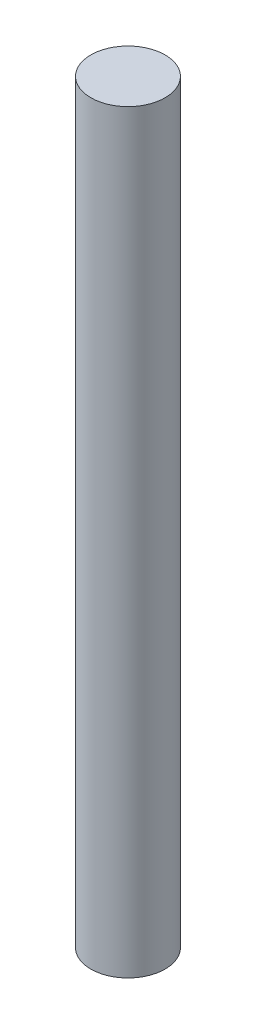
ISO-10303-21;
HEADER;
FILE_DESCRIPTION(('STEP AP214'),'2;1');
FILE_NAME('part.step','',(''),(''),'','','');
FILE_SCHEMA(('AUTOMOTIVE_DESIGN { 1 0 10303 214 1 1 1 1 }'));
ENDSEC;
DATA;
#1=APPLICATION_CONTEXT('core data for automotive mechanical design processes');
#2=APPLICATION_PROTOCOL_DEFINITION('international standard','automotive_design',2000,#1);
#3=PRODUCT_CONTEXT('',#1,'mechanical');
#4=PRODUCT('Part','Part','',(#3));
#5=PRODUCT_RELATED_PRODUCT_CATEGORY('part','',(#4));
#6=PRODUCT_DEFINITION_FORMATION('','',#4);
#7=PRODUCT_DEFINITION_CONTEXT('part definition',#1,'design');
#8=PRODUCT_DEFINITION('design','',#6,#7);
#9=PRODUCT_DEFINITION_SHAPE('','',#8);
#10=(LENGTH_UNIT() NAMED_UNIT(*) SI_UNIT(.MILLI.,.METRE.));
#11=(NAMED_UNIT(*) PLANE_ANGLE_UNIT() SI_UNIT($,.RADIAN.));
#12=(NAMED_UNIT(*) SI_UNIT($,.STERADIAN.) SOLID_ANGLE_UNIT());
#13=UNCERTAINTY_MEASURE_WITH_UNIT(LENGTH_MEASURE(1.E-05),#10,'distance_accuracy_value','');
#14=(GEOMETRIC_REPRESENTATION_CONTEXT(3) GLOBAL_UNCERTAINTY_ASSIGNED_CONTEXT((#13)) GLOBAL_UNIT_ASSIGNED_CONTEXT((#10,
#11,#12)) REPRESENTATION_CONTEXT('',''));
#15=CARTESIAN_POINT('',(0.,0.,0.));
#16=DIRECTION('',(0.,0.,1.));
#17=DIRECTION('',(1.,0.,0.));
#18=AXIS2_PLACEMENT_3D('',#15,#16,#17);
#19=CARTESIAN_POINT('',(0.,50.8,0.));
#20=DIRECTION('',(0.,-1.,0.));
#21=DIRECTION('',(0.,0.,-1.));
#22=AXIS2_PLACEMENT_3D('',#19,#20,#21);
#23=CYLINDRICAL_SURFACE('',#22,2.5);
#24=CARTESIAN_POINT('',(0.,50.8,0.));
#25=DIRECTION('',(0.,1.,0.));
#26=DIRECTION('',(0.,0.,1.));
#27=AXIS2_PLACEMENT_3D('',#24,#25,#26);
#28=CIRCLE('',#27,2.5);
#29=CARTESIAN_POINT('',(0.,50.8,2.5));
#30=VERTEX_POINT('',#29);
#31=EDGE_CURVE('E10',#30,#30,#28,.T.);
#32=ORIENTED_EDGE('',*,*,#31,.F.);
#33=EDGE_LOOP('',(#32));
#34=FACE_BOUND('',#33,.T.);
#35=CARTESIAN_POINT('',(0.,0.,0.));
#36=DIRECTION('',(0.,1.,0.));
#37=DIRECTION('',(0.,0.,1.));
#38=AXIS2_PLACEMENT_3D('',#35,#36,#37);
#39=CIRCLE('',#38,2.5);
#40=CARTESIAN_POINT('',(0.,0.,2.5));
#41=VERTEX_POINT('',#40);
#42=EDGE_CURVE('E40',#41,#41,#39,.T.);
#43=ORIENTED_EDGE('',*,*,#42,.T.);
#44=EDGE_LOOP('',(#43));
#45=FACE_BOUND('',#44,.T.);
#46=ADVANCED_FACE('F37',(#34,#45),#23,.T.);
#47=CARTESIAN_POINT('',(0.,50.8,0.));
#48=DIRECTION('',(0.,1.,0.));
#49=DIRECTION('',(0.,0.,1.));
#50=AXIS2_PLACEMENT_3D('',#47,#48,#49);
#51=PLANE('',#50);
#52=ORIENTED_EDGE('',*,*,#31,.T.);
#53=EDGE_LOOP('',(#52));
#54=FACE_BOUND('',#53,.T.);
#55=ADVANCED_FACE('F54',(#54),#51,.T.);
#56=CARTESIAN_POINT('',(0.,0.,0.));
#57=DIRECTION('',(0.,1.,0.));
#58=DIRECTION('',(0.,0.,1.));
#59=AXIS2_PLACEMENT_3D('',#56,#57,#58);
#60=PLANE('',#59);
#61=ORIENTED_EDGE('',*,*,#42,.F.);
#62=EDGE_LOOP('',(#61));
#63=FACE_BOUND('',#62,.T.);
#64=ADVANCED_FACE('F52',(#63),#60,.F.);
#65=CLOSED_SHELL('',(#46,#55,#64));
#66=MANIFOLD_SOLID_BREP('B2',#65);
#67=ADVANCED_BREP_SHAPE_REPRESENTATION('',(#18,#66),#14);
#68=SHAPE_DEFINITION_REPRESENTATION(#9,#67);
ENDSEC;
END-ISO-10303-21;
